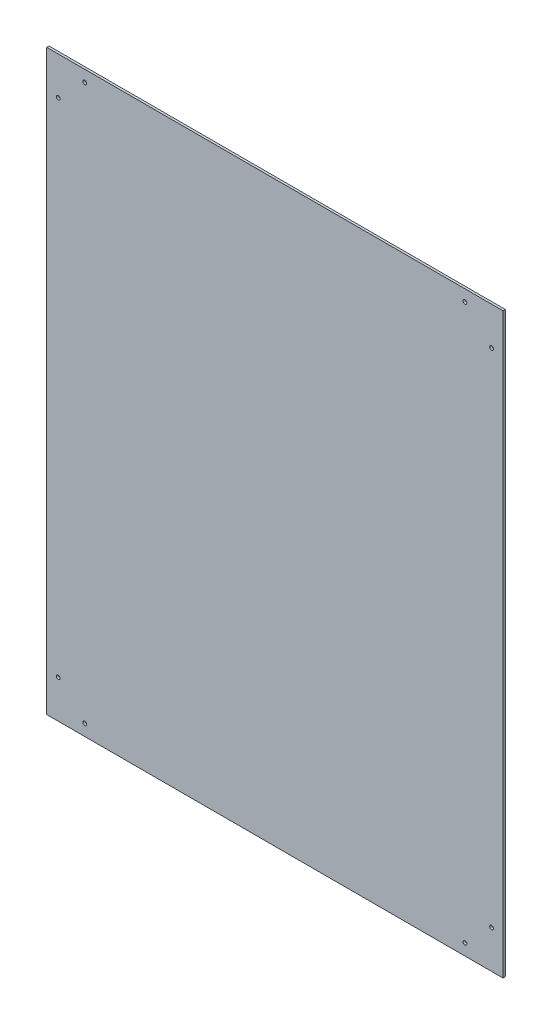
ISO-10303-21;
HEADER;
FILE_DESCRIPTION(('STEP AP214'),'2;1');
FILE_NAME('part.step','',(''),(''),'','','');
FILE_SCHEMA(('AUTOMOTIVE_DESIGN { 1 0 10303 214 1 1 1 1 }'));
ENDSEC;
DATA;
#1=APPLICATION_CONTEXT('core data for automotive mechanical design processes');
#2=APPLICATION_PROTOCOL_DEFINITION('international standard','automotive_design',2000,#1);
#3=PRODUCT_CONTEXT('',#1,'mechanical');
#4=PRODUCT('Part','Part','',(#3));
#5=PRODUCT_RELATED_PRODUCT_CATEGORY('part','',(#4));
#6=PRODUCT_DEFINITION_FORMATION('','',#4);
#7=PRODUCT_DEFINITION_CONTEXT('part definition',#1,'design');
#8=PRODUCT_DEFINITION('design','',#6,#7);
#9=PRODUCT_DEFINITION_SHAPE('','',#8);
#10=(LENGTH_UNIT() NAMED_UNIT(*) SI_UNIT(.MILLI.,.METRE.));
#11=(NAMED_UNIT(*) PLANE_ANGLE_UNIT() SI_UNIT($,.RADIAN.));
#12=(NAMED_UNIT(*) SI_UNIT($,.STERADIAN.) SOLID_ANGLE_UNIT());
#13=UNCERTAINTY_MEASURE_WITH_UNIT(LENGTH_MEASURE(1.E-05),#10,'distance_accuracy_value','');
#14=(GEOMETRIC_REPRESENTATION_CONTEXT(3) GLOBAL_UNCERTAINTY_ASSIGNED_CONTEXT((#13)) GLOBAL_UNIT_ASSIGNED_CONTEXT((#10,
#11,#12)) REPRESENTATION_CONTEXT('',''));
#15=CARTESIAN_POINT('',(0.,0.,0.));
#16=DIRECTION('',(0.,0.,1.));
#17=DIRECTION('',(1.,0.,0.));
#18=AXIS2_PLACEMENT_3D('',#15,#16,#17);
#19=CARTESIAN_POINT('',(0.,0.,3.));
#20=DIRECTION('',(1.,0.,0.));
#21=DIRECTION('',(0.,0.,-1.));
#22=AXIS2_PLACEMENT_3D('',#19,#20,#21);
#23=PLANE('',#22);
#24=DIRECTION('',(0.,-1.,0.));
#25=VECTOR('',#24,1.);
#26=CARTESIAN_POINT('',(0.,0.,0.));
#27=LINE('',#26,#25);
#28=CARTESIAN_POINT('',(0.,760.,0.));
#29=VERTEX_POINT('',#28);
#30=CARTESIAN_POINT('',(0.,0.,0.));
#31=VERTEX_POINT('',#30);
#32=EDGE_CURVE('E96',#29,#31,#27,.T.);
#33=ORIENTED_EDGE('',*,*,#32,.T.);
#34=DIRECTION('',(0.,0.,-1.));
#35=VECTOR('',#34,1.);
#36=CARTESIAN_POINT('',(0.,0.,3.));
#37=LINE('',#36,#35);
#38=CARTESIAN_POINT('',(0.,0.,3.));
#39=VERTEX_POINT('',#38);
#40=EDGE_CURVE('E11',#39,#31,#37,.T.);
#41=ORIENTED_EDGE('',*,*,#40,.F.);
#42=DIRECTION('',(0.,-1.,0.));
#43=VECTOR('',#42,1.);
#44=CARTESIAN_POINT('',(0.,0.,3.));
#45=LINE('',#44,#43);
#46=CARTESIAN_POINT('',(0.,760.,3.));
#47=VERTEX_POINT('',#46);
#48=EDGE_CURVE('E84',#47,#39,#45,.T.);
#49=ORIENTED_EDGE('',*,*,#48,.F.);
#50=DIRECTION('',(0.,0.,-1.));
#51=VECTOR('',#50,1.);
#52=CARTESIAN_POINT('',(0.,760.,3.));
#53=LINE('',#52,#51);
#54=EDGE_CURVE('E92',#47,#29,#53,.T.);
#55=ORIENTED_EDGE('',*,*,#54,.T.);
#56=EDGE_LOOP('',(#33,#41,#49,#55));
#57=FACE_BOUND('',#56,.T.);
#58=ADVANCED_FACE('F33',(#57),#23,.F.);
#59=CARTESIAN_POINT('',(0.,0.,3.));
#60=DIRECTION('',(0.,1.,0.));
#61=DIRECTION('',(0.,0.,1.));
#62=AXIS2_PLACEMENT_3D('',#59,#60,#61);
#63=PLANE('',#62);
#64=DIRECTION('',(1.,0.,0.));
#65=VECTOR('',#64,1.);
#66=CARTESIAN_POINT('',(0.,0.,0.));
#67=LINE('',#66,#65);
#68=CARTESIAN_POINT('',(600.,0.,0.));
#69=VERTEX_POINT('',#68);
#70=EDGE_CURVE('E88',#31,#69,#67,.T.);
#71=ORIENTED_EDGE('',*,*,#70,.T.);
#72=DIRECTION('',(0.,0.,-1.));
#73=VECTOR('',#72,1.);
#74=CARTESIAN_POINT('',(600.,0.,3.));
#75=LINE('',#74,#73);
#76=CARTESIAN_POINT('',(600.,0.,3.));
#77=VERTEX_POINT('',#76);
#78=EDGE_CURVE('E41',#77,#69,#75,.T.);
#79=ORIENTED_EDGE('',*,*,#78,.F.);
#80=DIRECTION('',(1.,0.,0.));
#81=VECTOR('',#80,1.);
#82=CARTESIAN_POINT('',(0.,0.,3.));
#83=LINE('',#82,#81);
#84=EDGE_CURVE('E79',#39,#77,#83,.T.);
#85=ORIENTED_EDGE('',*,*,#84,.F.);
#86=ORIENTED_EDGE('',*,*,#40,.T.);
#87=EDGE_LOOP('',(#71,#79,#85,#86));
#88=FACE_BOUND('',#87,.T.);
#89=ADVANCED_FACE('F87',(#88),#63,.F.);
#90=CARTESIAN_POINT('',(600.,0.,3.));
#91=DIRECTION('',(-1.,0.,0.));
#92=DIRECTION('',(0.,0.,1.));
#93=AXIS2_PLACEMENT_3D('',#90,#91,#92);
#94=PLANE('',#93);
#95=DIRECTION('',(0.,1.,0.));
#96=VECTOR('',#95,1.);
#97=CARTESIAN_POINT('',(600.,0.,0.));
#98=LINE('',#97,#96);
#99=CARTESIAN_POINT('',(600.,760.,0.));
#100=VERTEX_POINT('',#99);
#101=EDGE_CURVE('E66',#69,#100,#98,.T.);
#102=ORIENTED_EDGE('',*,*,#101,.T.);
#103=DIRECTION('',(0.,0.,-1.));
#104=VECTOR('',#103,1.);
#105=CARTESIAN_POINT('',(600.,760.,3.));
#106=LINE('',#105,#104);
#107=CARTESIAN_POINT('',(600.,760.,3.));
#108=VERTEX_POINT('',#107);
#109=EDGE_CURVE('E89',#108,#100,#106,.T.);
#110=ORIENTED_EDGE('',*,*,#109,.F.);
#111=DIRECTION('',(0.,1.,0.));
#112=VECTOR('',#111,1.);
#113=CARTESIAN_POINT('',(600.,0.,3.));
#114=LINE('',#113,#112);
#115=EDGE_CURVE('E82',#77,#108,#114,.T.);
#116=ORIENTED_EDGE('',*,*,#115,.F.);
#117=ORIENTED_EDGE('',*,*,#78,.T.);
#118=EDGE_LOOP('',(#102,#110,#116,#117));
#119=FACE_BOUND('',#118,.T.);
#120=ADVANCED_FACE('F90',(#119),#94,.F.);
#121=CARTESIAN_POINT('',(0.,760.,3.));
#122=DIRECTION('',(0.,-1.,0.));
#123=DIRECTION('',(0.,0.,-1.));
#124=AXIS2_PLACEMENT_3D('',#121,#122,#123);
#125=PLANE('',#124);
#126=DIRECTION('',(-1.,0.,0.));
#127=VECTOR('',#126,1.);
#128=CARTESIAN_POINT('',(0.,760.,0.));
#129=LINE('',#128,#127);
#130=EDGE_CURVE('E72',#100,#29,#129,.T.);
#131=ORIENTED_EDGE('',*,*,#130,.T.);
#132=ORIENTED_EDGE('',*,*,#54,.F.);
#133=DIRECTION('',(-1.,0.,0.));
#134=VECTOR('',#133,1.);
#135=CARTESIAN_POINT('',(0.,760.,3.));
#136=LINE('',#135,#134);
#137=EDGE_CURVE('E49',#108,#47,#136,.T.);
#138=ORIENTED_EDGE('',*,*,#137,.F.);
#139=ORIENTED_EDGE('',*,*,#109,.T.);
#140=EDGE_LOOP('',(#131,#132,#138,#139));
#141=FACE_BOUND('',#140,.T.);
#142=ADVANCED_FACE('F104',(#141),#125,.F.);
#143=CARTESIAN_POINT('',(0.,760.,3.));
#144=DIRECTION('',(0.,0.,-1.));
#145=DIRECTION('',(-1.,0.,0.));
#146=AXIS2_PLACEMENT_3D('',#143,#144,#145);
#147=PLANE('',#146);
#148=CARTESIAN_POINT('',(550.,745.,3.));
#149=DIRECTION('',(0.,0.,1.));
#150=DIRECTION('',(-1.,0.,0.));
#151=AXIS2_PLACEMENT_3D('',#148,#149,#150);
#152=CIRCLE('',#151,2.50000000000013);
#153=CARTESIAN_POINT('',(547.5,745.,3.));
#154=VERTEX_POINT('',#153);
#155=EDGE_CURVE('E152',#154,#154,#152,.T.);
#156=ORIENTED_EDGE('',*,*,#155,.F.);
#157=EDGE_LOOP('',(#156));
#158=FACE_BOUND('',#157,.T.);
#159=CARTESIAN_POINT('',(585.,710.,3.));
#160=DIRECTION('',(0.,0.,1.));
#161=DIRECTION('',(-1.,0.,0.));
#162=AXIS2_PLACEMENT_3D('',#159,#160,#161);
#163=CIRCLE('',#162,2.49999999999992);
#164=CARTESIAN_POINT('',(582.5,710.,3.));
#165=VERTEX_POINT('',#164);
#166=EDGE_CURVE('E146',#165,#165,#163,.T.);
#167=ORIENTED_EDGE('',*,*,#166,.F.);
#168=EDGE_LOOP('',(#167));
#169=FACE_BOUND('',#168,.T.);
#170=CARTESIAN_POINT('',(585.,50.,3.));
#171=DIRECTION('',(0.,0.,1.));
#172=DIRECTION('',(-1.,0.,0.));
#173=AXIS2_PLACEMENT_3D('',#170,#171,#172);
#174=CIRCLE('',#173,2.49999999999992);
#175=CARTESIAN_POINT('',(582.5,50.,3.));
#176=VERTEX_POINT('',#175);
#177=EDGE_CURVE('E140',#176,#176,#174,.T.);
#178=ORIENTED_EDGE('',*,*,#177,.F.);
#179=EDGE_LOOP('',(#178));
#180=FACE_BOUND('',#179,.T.);
#181=CARTESIAN_POINT('',(550.,15.,3.));
#182=DIRECTION('',(0.,0.,1.));
#183=DIRECTION('',(-1.,0.,0.));
#184=AXIS2_PLACEMENT_3D('',#181,#182,#183);
#185=CIRCLE('',#184,2.50000000000013);
#186=CARTESIAN_POINT('',(547.5,15.,3.));
#187=VERTEX_POINT('',#186);
#188=EDGE_CURVE('E134',#187,#187,#185,.T.);
#189=ORIENTED_EDGE('',*,*,#188,.F.);
#190=EDGE_LOOP('',(#189));
#191=FACE_BOUND('',#190,.T.);
#192=CARTESIAN_POINT('',(50.,15.,3.));
#193=DIRECTION('',(0.,0.,1.));
#194=DIRECTION('',(1.,0.,0.));
#195=AXIS2_PLACEMENT_3D('',#192,#193,#194);
#196=CIRCLE('',#195,2.5);
#197=CARTESIAN_POINT('',(52.5,15.,3.));
#198=VERTEX_POINT('',#197);
#199=EDGE_CURVE('E128',#198,#198,#196,.T.);
#200=ORIENTED_EDGE('',*,*,#199,.F.);
#201=EDGE_LOOP('',(#200));
#202=FACE_BOUND('',#201,.T.);
#203=CARTESIAN_POINT('',(15.,50.,3.));
#204=DIRECTION('',(0.,0.,1.));
#205=DIRECTION('',(1.,0.,0.));
#206=AXIS2_PLACEMENT_3D('',#203,#204,#205);
#207=CIRCLE('',#206,2.5);
#208=CARTESIAN_POINT('',(17.5,50.,3.));
#209=VERTEX_POINT('',#208);
#210=EDGE_CURVE('E122',#209,#209,#207,.T.);
#211=ORIENTED_EDGE('',*,*,#210,.F.);
#212=EDGE_LOOP('',(#211));
#213=FACE_BOUND('',#212,.T.);
#214=CARTESIAN_POINT('',(15.,710.,3.));
#215=DIRECTION('',(0.,0.,1.));
#216=DIRECTION('',(1.,0.,0.));
#217=AXIS2_PLACEMENT_3D('',#214,#215,#216);
#218=CIRCLE('',#217,2.5);
#219=CARTESIAN_POINT('',(17.5,710.,3.));
#220=VERTEX_POINT('',#219);
#221=EDGE_CURVE('E116',#220,#220,#218,.T.);
#222=ORIENTED_EDGE('',*,*,#221,.F.);
#223=EDGE_LOOP('',(#222));
#224=FACE_BOUND('',#223,.T.);
#225=CARTESIAN_POINT('',(50.,745.,3.));
#226=DIRECTION('',(0.,0.,1.));
#227=DIRECTION('',(1.,0.,0.));
#228=AXIS2_PLACEMENT_3D('',#225,#226,#227);
#229=CIRCLE('',#228,2.5);
#230=CARTESIAN_POINT('',(52.5,745.,3.));
#231=VERTEX_POINT('',#230);
#232=EDGE_CURVE('E110',#231,#231,#229,.T.);
#233=ORIENTED_EDGE('',*,*,#232,.F.);
#234=EDGE_LOOP('',(#233));
#235=FACE_BOUND('',#234,.T.);
#236=ORIENTED_EDGE('',*,*,#48,.T.);
#237=ORIENTED_EDGE('',*,*,#84,.T.);
#238=ORIENTED_EDGE('',*,*,#115,.T.);
#239=ORIENTED_EDGE('',*,*,#137,.T.);
#240=EDGE_LOOP('',(#236,#237,#238,#239));
#241=FACE_BOUND('',#240,.T.);
#242=ADVANCED_FACE('F80',(#158,#169,#180,#191,#202,#213,#224,#235,#241),#147,.F.);
#243=CARTESIAN_POINT('',(0.,760.,0.));
#244=DIRECTION('',(0.,0.,-1.));
#245=DIRECTION('',(-1.,0.,0.));
#246=AXIS2_PLACEMENT_3D('',#243,#244,#245);
#247=PLANE('',#246);
#248=CARTESIAN_POINT('',(550.,745.,0.));
#249=DIRECTION('',(0.,0.,1.));
#250=DIRECTION('',(-1.,0.,0.));
#251=AXIS2_PLACEMENT_3D('',#248,#249,#250);
#252=CIRCLE('',#251,2.50000000000013);
#253=CARTESIAN_POINT('',(547.5,745.,0.));
#254=VERTEX_POINT('',#253);
#255=EDGE_CURVE('E149',#254,#254,#252,.T.);
#256=ORIENTED_EDGE('',*,*,#255,.T.);
#257=EDGE_LOOP('',(#256));
#258=FACE_BOUND('',#257,.T.);
#259=CARTESIAN_POINT('',(585.,710.,0.));
#260=DIRECTION('',(0.,0.,1.));
#261=DIRECTION('',(-1.,0.,0.));
#262=AXIS2_PLACEMENT_3D('',#259,#260,#261);
#263=CIRCLE('',#262,2.49999999999992);
#264=CARTESIAN_POINT('',(582.5,710.,0.));
#265=VERTEX_POINT('',#264);
#266=EDGE_CURVE('E143',#265,#265,#263,.T.);
#267=ORIENTED_EDGE('',*,*,#266,.T.);
#268=EDGE_LOOP('',(#267));
#269=FACE_BOUND('',#268,.T.);
#270=CARTESIAN_POINT('',(585.,50.,0.));
#271=DIRECTION('',(0.,0.,1.));
#272=DIRECTION('',(-1.,0.,0.));
#273=AXIS2_PLACEMENT_3D('',#270,#271,#272);
#274=CIRCLE('',#273,2.49999999999992);
#275=CARTESIAN_POINT('',(582.5,50.,0.));
#276=VERTEX_POINT('',#275);
#277=EDGE_CURVE('E137',#276,#276,#274,.T.);
#278=ORIENTED_EDGE('',*,*,#277,.T.);
#279=EDGE_LOOP('',(#278));
#280=FACE_BOUND('',#279,.T.);
#281=CARTESIAN_POINT('',(550.,15.,0.));
#282=DIRECTION('',(0.,0.,1.));
#283=DIRECTION('',(-1.,0.,0.));
#284=AXIS2_PLACEMENT_3D('',#281,#282,#283);
#285=CIRCLE('',#284,2.50000000000013);
#286=CARTESIAN_POINT('',(547.5,15.,0.));
#287=VERTEX_POINT('',#286);
#288=EDGE_CURVE('E131',#287,#287,#285,.T.);
#289=ORIENTED_EDGE('',*,*,#288,.T.);
#290=EDGE_LOOP('',(#289));
#291=FACE_BOUND('',#290,.T.);
#292=CARTESIAN_POINT('',(50.,15.,0.));
#293=DIRECTION('',(0.,0.,1.));
#294=DIRECTION('',(1.,0.,0.));
#295=AXIS2_PLACEMENT_3D('',#292,#293,#294);
#296=CIRCLE('',#295,2.5);
#297=CARTESIAN_POINT('',(52.5,15.,0.));
#298=VERTEX_POINT('',#297);
#299=EDGE_CURVE('E125',#298,#298,#296,.T.);
#300=ORIENTED_EDGE('',*,*,#299,.T.);
#301=EDGE_LOOP('',(#300));
#302=FACE_BOUND('',#301,.T.);
#303=CARTESIAN_POINT('',(15.,50.,0.));
#304=DIRECTION('',(0.,0.,1.));
#305=DIRECTION('',(1.,0.,0.));
#306=AXIS2_PLACEMENT_3D('',#303,#304,#305);
#307=CIRCLE('',#306,2.5);
#308=CARTESIAN_POINT('',(17.5,50.,0.));
#309=VERTEX_POINT('',#308);
#310=EDGE_CURVE('E119',#309,#309,#307,.T.);
#311=ORIENTED_EDGE('',*,*,#310,.T.);
#312=EDGE_LOOP('',(#311));
#313=FACE_BOUND('',#312,.T.);
#314=CARTESIAN_POINT('',(15.,710.,0.));
#315=DIRECTION('',(0.,0.,1.));
#316=DIRECTION('',(1.,0.,0.));
#317=AXIS2_PLACEMENT_3D('',#314,#315,#316);
#318=CIRCLE('',#317,2.5);
#319=CARTESIAN_POINT('',(17.5,710.,0.));
#320=VERTEX_POINT('',#319);
#321=EDGE_CURVE('E113',#320,#320,#318,.T.);
#322=ORIENTED_EDGE('',*,*,#321,.T.);
#323=EDGE_LOOP('',(#322));
#324=FACE_BOUND('',#323,.T.);
#325=CARTESIAN_POINT('',(50.,745.,0.));
#326=DIRECTION('',(0.,0.,1.));
#327=DIRECTION('',(1.,0.,0.));
#328=AXIS2_PLACEMENT_3D('',#325,#326,#327);
#329=CIRCLE('',#328,2.5);
#330=CARTESIAN_POINT('',(52.5,745.,0.));
#331=VERTEX_POINT('',#330);
#332=EDGE_CURVE('E99',#331,#331,#329,.T.);
#333=ORIENTED_EDGE('',*,*,#332,.T.);
#334=EDGE_LOOP('',(#333));
#335=FACE_BOUND('',#334,.T.);
#336=ORIENTED_EDGE('',*,*,#32,.F.);
#337=ORIENTED_EDGE('',*,*,#130,.F.);
#338=ORIENTED_EDGE('',*,*,#101,.F.);
#339=ORIENTED_EDGE('',*,*,#70,.F.);
#340=EDGE_LOOP('',(#336,#337,#338,#339));
#341=FACE_BOUND('',#340,.T.);
#342=ADVANCED_FACE('F107',(#258,#269,#280,#291,#302,#313,#324,#335,#341),#247,.T.);
#343=CARTESIAN_POINT('',(50.,745.,0.));
#344=DIRECTION('',(0.,0.,1.));
#345=DIRECTION('',(1.,0.,0.));
#346=AXIS2_PLACEMENT_3D('',#343,#344,#345);
#347=CYLINDRICAL_SURFACE('',#346,2.5);
#348=ORIENTED_EDGE('',*,*,#332,.F.);
#349=EDGE_LOOP('',(#348));
#350=FACE_BOUND('',#349,.T.);
#351=ORIENTED_EDGE('',*,*,#232,.T.);
#352=EDGE_LOOP('',(#351));
#353=FACE_BOUND('',#352,.T.);
#354=ADVANCED_FACE('F184',(#350,#353),#347,.F.);
#355=CARTESIAN_POINT('',(15.,710.,0.));
#356=DIRECTION('',(0.,0.,1.));
#357=DIRECTION('',(1.,0.,0.));
#358=AXIS2_PLACEMENT_3D('',#355,#356,#357);
#359=CYLINDRICAL_SURFACE('',#358,2.5);
#360=ORIENTED_EDGE('',*,*,#321,.F.);
#361=EDGE_LOOP('',(#360));
#362=FACE_BOUND('',#361,.T.);
#363=ORIENTED_EDGE('',*,*,#221,.T.);
#364=EDGE_LOOP('',(#363));
#365=FACE_BOUND('',#364,.T.);
#366=ADVANCED_FACE('F186',(#362,#365),#359,.F.);
#367=CARTESIAN_POINT('',(15.,50.,0.));
#368=DIRECTION('',(0.,0.,1.));
#369=DIRECTION('',(1.,0.,0.));
#370=AXIS2_PLACEMENT_3D('',#367,#368,#369);
#371=CYLINDRICAL_SURFACE('',#370,2.5);
#372=ORIENTED_EDGE('',*,*,#310,.F.);
#373=EDGE_LOOP('',(#372));
#374=FACE_BOUND('',#373,.T.);
#375=ORIENTED_EDGE('',*,*,#210,.T.);
#376=EDGE_LOOP('',(#375));
#377=FACE_BOUND('',#376,.T.);
#378=ADVANCED_FACE('F193',(#374,#377),#371,.F.);
#379=CARTESIAN_POINT('',(50.,15.,0.));
#380=DIRECTION('',(0.,0.,1.));
#381=DIRECTION('',(1.,0.,0.));
#382=AXIS2_PLACEMENT_3D('',#379,#380,#381);
#383=CYLINDRICAL_SURFACE('',#382,2.5);
#384=ORIENTED_EDGE('',*,*,#299,.F.);
#385=EDGE_LOOP('',(#384));
#386=FACE_BOUND('',#385,.T.);
#387=ORIENTED_EDGE('',*,*,#199,.T.);
#388=EDGE_LOOP('',(#387));
#389=FACE_BOUND('',#388,.T.);
#390=ADVANCED_FACE('F239',(#386,#389),#383,.F.);
#391=CARTESIAN_POINT('',(550.,15.,0.));
#392=DIRECTION('',(0.,0.,1.));
#393=DIRECTION('',(1.,0.,0.));
#394=AXIS2_PLACEMENT_3D('',#391,#392,#393);
#395=CYLINDRICAL_SURFACE('',#394,2.50000000000013);
#396=ORIENTED_EDGE('',*,*,#288,.F.);
#397=EDGE_LOOP('',(#396));
#398=FACE_BOUND('',#397,.T.);
#399=ORIENTED_EDGE('',*,*,#188,.T.);
#400=EDGE_LOOP('',(#399));
#401=FACE_BOUND('',#400,.T.);
#402=ADVANCED_FACE('F249',(#398,#401),#395,.F.);
#403=CARTESIAN_POINT('',(585.,50.,0.));
#404=DIRECTION('',(0.,0.,1.));
#405=DIRECTION('',(1.,0.,0.));
#406=AXIS2_PLACEMENT_3D('',#403,#404,#405);
#407=CYLINDRICAL_SURFACE('',#406,2.49999999999992);
#408=ORIENTED_EDGE('',*,*,#277,.F.);
#409=EDGE_LOOP('',(#408));
#410=FACE_BOUND('',#409,.T.);
#411=ORIENTED_EDGE('',*,*,#177,.T.);
#412=EDGE_LOOP('',(#411));
#413=FACE_BOUND('',#412,.T.);
#414=ADVANCED_FACE('F259',(#410,#413),#407,.F.);
#415=CARTESIAN_POINT('',(585.,710.,0.));
#416=DIRECTION('',(0.,0.,1.));
#417=DIRECTION('',(1.,0.,0.));
#418=AXIS2_PLACEMENT_3D('',#415,#416,#417);
#419=CYLINDRICAL_SURFACE('',#418,2.49999999999992);
#420=ORIENTED_EDGE('',*,*,#266,.F.);
#421=EDGE_LOOP('',(#420));
#422=FACE_BOUND('',#421,.T.);
#423=ORIENTED_EDGE('',*,*,#166,.T.);
#424=EDGE_LOOP('',(#423));
#425=FACE_BOUND('',#424,.T.);
#426=ADVANCED_FACE('F163',(#422,#425),#419,.F.);
#427=CARTESIAN_POINT('',(550.,745.,0.));
#428=DIRECTION('',(0.,0.,1.));
#429=DIRECTION('',(1.,0.,0.));
#430=AXIS2_PLACEMENT_3D('',#427,#428,#429);
#431=CYLINDRICAL_SURFACE('',#430,2.50000000000013);
#432=ORIENTED_EDGE('',*,*,#255,.F.);
#433=EDGE_LOOP('',(#432));
#434=FACE_BOUND('',#433,.T.);
#435=ORIENTED_EDGE('',*,*,#155,.T.);
#436=EDGE_LOOP('',(#435));
#437=FACE_BOUND('',#436,.T.);
#438=ADVANCED_FACE('F160',(#434,#437),#431,.F.);
#439=CLOSED_SHELL('',(#58,#89,#120,#142,#242,#342,#354,#366,#378,#390,#402,#414,#426,#438));
#440=MANIFOLD_SOLID_BREP('B2',#439);
#441=ADVANCED_BREP_SHAPE_REPRESENTATION('',(#18,#440),#14);
#442=SHAPE_DEFINITION_REPRESENTATION(#9,#441);
ENDSEC;
END-ISO-10303-21;
